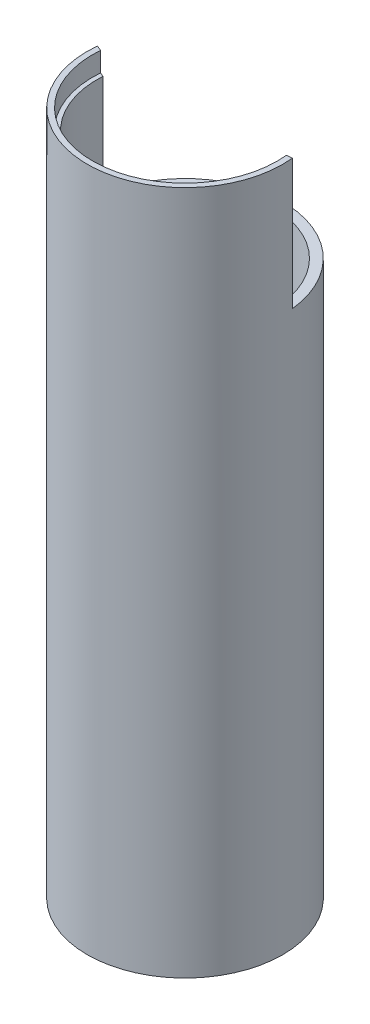
ISO-10303-21;
HEADER;
FILE_DESCRIPTION(('STEP AP214'),'2;1');
FILE_NAME('part.step','',(''),(''),'','','');
FILE_SCHEMA(('AUTOMOTIVE_DESIGN { 1 0 10303 214 1 1 1 1 }'));
ENDSEC;
DATA;
#1=APPLICATION_CONTEXT('core data for automotive mechanical design processes');
#2=APPLICATION_PROTOCOL_DEFINITION('international standard','automotive_design',2000,#1);
#3=PRODUCT_CONTEXT('',#1,'mechanical');
#4=PRODUCT('Part','Part','',(#3));
#5=PRODUCT_RELATED_PRODUCT_CATEGORY('part','',(#4));
#6=PRODUCT_DEFINITION_FORMATION('','',#4);
#7=PRODUCT_DEFINITION_CONTEXT('part definition',#1,'design');
#8=PRODUCT_DEFINITION('design','',#6,#7);
#9=PRODUCT_DEFINITION_SHAPE('','',#8);
#10=(LENGTH_UNIT() NAMED_UNIT(*) SI_UNIT(.MILLI.,.METRE.));
#11=(NAMED_UNIT(*) PLANE_ANGLE_UNIT() SI_UNIT($,.RADIAN.));
#12=(NAMED_UNIT(*) SI_UNIT($,.STERADIAN.) SOLID_ANGLE_UNIT());
#13=UNCERTAINTY_MEASURE_WITH_UNIT(LENGTH_MEASURE(1.E-05),#10,'distance_accuracy_value','');
#14=(GEOMETRIC_REPRESENTATION_CONTEXT(3) GLOBAL_UNCERTAINTY_ASSIGNED_CONTEXT((#13)) GLOBAL_UNIT_ASSIGNED_CONTEXT((#10,
#11,#12)) REPRESENTATION_CONTEXT('',''));
#15=CARTESIAN_POINT('',(0.,0.,0.));
#16=DIRECTION('',(0.,0.,1.));
#17=DIRECTION('',(1.,0.,0.));
#18=AXIS2_PLACEMENT_3D('',#15,#16,#17);
#19=CARTESIAN_POINT('',(0.,105.,0.));
#20=DIRECTION('',(0.,-1.,0.));
#21=DIRECTION('',(0.,0.,-1.));
#22=AXIS2_PLACEMENT_3D('',#19,#20,#21);
#23=CYLINDRICAL_SURFACE('',#22,13.5);
#24=DIRECTION('',(0.,1.,0.));
#25=VECTOR('',#24,1.);
#26=CARTESIAN_POINT('',(13.4267182081246,85.,-1.40471995771921));
#27=LINE('',#26,#25);
#28=CARTESIAN_POINT('',(13.4267182081246,85.,-1.40471995771921));
#29=VERTEX_POINT('',#28);
#30=CARTESIAN_POINT('',(13.4267182081246,102.,-1.40471995771921));
#31=VERTEX_POINT('',#30);
#32=EDGE_CURVE('E124',#29,#31,#27,.T.);
#33=ORIENTED_EDGE('',*,*,#32,.F.);
#34=CARTESIAN_POINT('',(0.,85.,0.));
#35=DIRECTION('',(0.,-1.,0.));
#36=DIRECTION('',(0.,0.,-1.));
#37=AXIS2_PLACEMENT_3D('',#34,#35,#36);
#38=CIRCLE('',#37,13.5);
#39=CARTESIAN_POINT('',(-13.4707558704919,85.,-0.888108257819671));
#40=VERTEX_POINT('',#39);
#41=EDGE_CURVE('E135',#40,#29,#38,.T.);
#42=ORIENTED_EDGE('',*,*,#41,.F.);
#43=DIRECTION('',(0.,1.,0.));
#44=VECTOR('',#43,1.);
#45=CARTESIAN_POINT('',(-13.4707558704919,85.,-0.888108257819671));
#46=LINE('',#45,#44);
#47=CARTESIAN_POINT('',(-13.4707558704919,102.,-0.888108257819671));
#48=VERTEX_POINT('',#47);
#49=EDGE_CURVE('E100',#40,#48,#46,.T.);
#50=ORIENTED_EDGE('',*,*,#49,.T.);
#51=CARTESIAN_POINT('',(0.,102.,0.));
#52=DIRECTION('',(0.,1.,0.));
#53=DIRECTION('',(0.,0.,1.));
#54=AXIS2_PLACEMENT_3D('',#51,#52,#53);
#55=CIRCLE('',#54,13.5);
#56=EDGE_CURVE('E143',#48,#31,#55,.T.);
#57=ORIENTED_EDGE('',*,*,#56,.T.);
#58=EDGE_LOOP('',(#33,#42,#50,#57));
#59=FACE_BOUND('',#58,.T.);
#60=CARTESIAN_POINT('',(0.,3.,0.));
#61=DIRECTION('',(0.,-1.,0.));
#62=DIRECTION('',(0.,0.,-1.));
#63=AXIS2_PLACEMENT_3D('',#60,#61,#62);
#64=CIRCLE('',#63,13.5);
#65=CARTESIAN_POINT('',(0.,3.,-13.5));
#66=VERTEX_POINT('',#65);
#67=EDGE_CURVE('E147',#66,#66,#64,.F.);
#68=ORIENTED_EDGE('',*,*,#67,.F.);
#69=EDGE_LOOP('',(#68));
#70=FACE_BOUND('',#69,.T.);
#71=ADVANCED_FACE('F43',(#59,#70),#23,.F.);
#72=CARTESIAN_POINT('',(0.,105.,0.));
#73=DIRECTION('',(0.,-1.,0.));
#74=DIRECTION('',(0.,0.,-1.));
#75=AXIS2_PLACEMENT_3D('',#72,#73,#74);
#76=CYLINDRICAL_SURFACE('',#75,15.);
#77=CARTESIAN_POINT('',(0.,85.,0.));
#78=DIRECTION('',(0.,1.,0.));
#79=DIRECTION('',(0.,0.,-1.));
#80=AXIS2_PLACEMENT_3D('',#77,#78,#79);
#81=CIRCLE('',#80,15.);
#82=CARTESIAN_POINT('',(14.9185757868051,85.,-1.56079995302135));
#83=VERTEX_POINT('',#82);
#84=CARTESIAN_POINT('',(-14.9255274093062,85.,-1.49286019239847));
#85=VERTEX_POINT('',#84);
#86=EDGE_CURVE('E105',#83,#85,#81,.T.);
#87=ORIENTED_EDGE('',*,*,#86,.F.);
#88=DIRECTION('',(0.,1.,0.));
#89=VECTOR('',#88,1.);
#90=CARTESIAN_POINT('',(14.9185757868051,85.,-1.56079995302135));
#91=LINE('',#90,#89);
#92=CARTESIAN_POINT('',(14.9185757868051,105.,-1.56079995302135));
#93=VERTEX_POINT('',#92);
#94=EDGE_CURVE('E132',#83,#93,#91,.T.);
#95=ORIENTED_EDGE('',*,*,#94,.T.);
#96=CARTESIAN_POINT('',(0.,105.,0.));
#97=DIRECTION('',(0.,1.,0.));
#98=DIRECTION('',(0.,0.,1.));
#99=AXIS2_PLACEMENT_3D('',#96,#97,#98);
#100=CIRCLE('',#99,15.);
#101=CARTESIAN_POINT('',(-14.9255274093062,105.,-1.49286019239847));
#102=VERTEX_POINT('',#101);
#103=EDGE_CURVE('E119',#102,#93,#100,.T.);
#104=ORIENTED_EDGE('',*,*,#103,.F.);
#105=DIRECTION('',(0.,1.,0.));
#106=VECTOR('',#105,1.);
#107=CARTESIAN_POINT('',(-14.9255274093062,85.,-1.49286019239847));
#108=LINE('',#107,#106);
#109=EDGE_CURVE('E97',#85,#102,#108,.T.);
#110=ORIENTED_EDGE('',*,*,#109,.F.);
#111=EDGE_LOOP('',(#87,#95,#104,#110));
#112=FACE_BOUND('',#111,.T.);
#113=CARTESIAN_POINT('',(0.,0.,0.));
#114=DIRECTION('',(0.,1.,0.));
#115=DIRECTION('',(0.,0.,1.));
#116=AXIS2_PLACEMENT_3D('',#113,#114,#115);
#117=CIRCLE('',#116,15.);
#118=CARTESIAN_POINT('',(0.,0.,15.));
#119=VERTEX_POINT('',#118);
#120=EDGE_CURVE('E156',#119,#119,#117,.T.);
#121=ORIENTED_EDGE('',*,*,#120,.T.);
#122=EDGE_LOOP('',(#121));
#123=FACE_BOUND('',#122,.T.);
#124=ADVANCED_FACE('F45',(#112,#123),#76,.T.);
#125=CARTESIAN_POINT('',(0.,105.,0.));
#126=DIRECTION('',(0.,1.,0.));
#127=DIRECTION('',(0.,0.,1.));
#128=AXIS2_PLACEMENT_3D('',#125,#126,#127);
#129=PLANE('',#128);
#130=DIRECTION('',(0.994571719120343,0.,-0.104053330201423));
#131=VECTOR('',#130,1.);
#132=CARTESIAN_POINT('',(14.9185757868051,105.,-1.56079995302135));
#133=LINE('',#132,#131);
#134=CARTESIAN_POINT('',(14.0804741107957,105.,-1.4731167133317));
#135=VERTEX_POINT('',#134);
#136=EDGE_CURVE('E114',#135,#93,#133,.T.);
#137=ORIENTED_EDGE('',*,*,#136,.F.);
#138=CARTESIAN_POINT('',(0.,105.,0.));
#139=DIRECTION('',(0.,1.,0.));
#140=DIRECTION('',(0.,0.,1.));
#141=AXIS2_PLACEMENT_3D('',#138,#139,#140);
#142=CIRCLE('',#141,14.1573240422011);
#143=CARTESIAN_POINT('',(-14.1102182734001,105.,-1.15393427581033));
#144=VERTEX_POINT('',#143);
#145=EDGE_CURVE('E138',#144,#135,#142,.T.);
#146=ORIENTED_EDGE('',*,*,#145,.F.);
#147=DIRECTION('',(0.923392747761119,0.,0.383856527080329));
#148=VECTOR('',#147,1.);
#149=CARTESIAN_POINT('',(-13.4707558704919,105.,-0.888108257819671));
#150=LINE('',#149,#148);
#151=EDGE_CURVE('E183',#102,#144,#150,.T.);
#152=ORIENTED_EDGE('',*,*,#151,.F.);
#153=ORIENTED_EDGE('',*,*,#103,.T.);
#154=EDGE_LOOP('',(#137,#146,#152,#153));
#155=FACE_BOUND('',#154,.T.);
#156=ADVANCED_FACE('F181',(#155),#129,.T.);
#157=CARTESIAN_POINT('',(0.,0.,0.));
#158=DIRECTION('',(0.,1.,0.));
#159=DIRECTION('',(0.,0.,1.));
#160=AXIS2_PLACEMENT_3D('',#157,#158,#159);
#161=PLANE('',#160);
#162=CARTESIAN_POINT('',(0.,0.,0.));
#163=DIRECTION('',(0.,-1.,0.));
#164=DIRECTION('',(0.,0.,-1.));
#165=AXIS2_PLACEMENT_3D('',#162,#163,#164);
#166=CIRCLE('',#165,14.2220153833762);
#167=CARTESIAN_POINT('',(0.,0.,-14.2220153833762));
#168=VERTEX_POINT('',#167);
#169=EDGE_CURVE('E151',#168,#168,#166,.T.);
#170=ORIENTED_EDGE('',*,*,#169,.F.);
#171=EDGE_LOOP('',(#170));
#172=FACE_BOUND('',#171,.T.);
#173=ORIENTED_EDGE('',*,*,#120,.F.);
#174=EDGE_LOOP('',(#173));
#175=FACE_BOUND('',#174,.T.);
#176=ADVANCED_FACE('F191',(#172,#175),#161,.F.);
#177=CARTESIAN_POINT('',(0.,3.,0.));
#178=DIRECTION('',(0.,-1.,0.));
#179=DIRECTION('',(0.,0.,-1.));
#180=AXIS2_PLACEMENT_3D('',#177,#178,#179);
#181=CYLINDRICAL_SURFACE('',#180,14.2220153833762);
#182=CARTESIAN_POINT('',(0.,3.,0.));
#183=DIRECTION('',(0.,-1.,0.));
#184=DIRECTION('',(0.,0.,-1.));
#185=AXIS2_PLACEMENT_3D('',#182,#183,#184);
#186=CIRCLE('',#185,14.2220153833762);
#187=CARTESIAN_POINT('',(0.,3.,-14.2220153833762));
#188=VERTEX_POINT('',#187);
#189=EDGE_CURVE('E152',#188,#188,#186,.T.);
#190=ORIENTED_EDGE('',*,*,#189,.F.);
#191=EDGE_LOOP('',(#190));
#192=FACE_BOUND('',#191,.T.);
#193=ORIENTED_EDGE('',*,*,#169,.T.);
#194=EDGE_LOOP('',(#193));
#195=FACE_BOUND('',#194,.T.);
#196=ADVANCED_FACE('F197',(#192,#195),#181,.F.);
#197=CARTESIAN_POINT('',(0.,3.,0.));
#198=DIRECTION('',(0.,-1.,0.));
#199=DIRECTION('',(0.,0.,-1.));
#200=AXIS2_PLACEMENT_3D('',#197,#198,#199);
#201=PLANE('',#200);
#202=ORIENTED_EDGE('',*,*,#67,.T.);
#203=EDGE_LOOP('',(#202));
#204=FACE_BOUND('',#203,.T.);
#205=ORIENTED_EDGE('',*,*,#189,.T.);
#206=EDGE_LOOP('',(#205));
#207=FACE_BOUND('',#206,.T.);
#208=ADVANCED_FACE('F207',(#204,#207),#201,.T.);
#209=CARTESIAN_POINT('',(0.,102.,0.));
#210=DIRECTION('',(0.,1.,0.));
#211=DIRECTION('',(0.,0.,1.));
#212=AXIS2_PLACEMENT_3D('',#209,#210,#211);
#213=CYLINDRICAL_SURFACE('',#212,14.1573240422011);
#214=ORIENTED_EDGE('',*,*,#145,.T.);
#215=DIRECTION('',(0.,1.,0.));
#216=VECTOR('',#215,1.);
#217=CARTESIAN_POINT('',(14.0804741107957,102.,-1.4731167133317));
#218=LINE('',#217,#216);
#219=CARTESIAN_POINT('',(14.0804741107957,102.,-1.4731167133317));
#220=VERTEX_POINT('',#219);
#221=EDGE_CURVE('E131',#135,#220,#218,.F.);
#222=ORIENTED_EDGE('',*,*,#221,.T.);
#223=CARTESIAN_POINT('',(0.,102.,0.));
#224=DIRECTION('',(0.,1.,0.));
#225=DIRECTION('',(0.,0.,1.));
#226=AXIS2_PLACEMENT_3D('',#223,#224,#225);
#227=CIRCLE('',#226,14.1573240422011);
#228=CARTESIAN_POINT('',(-14.1102182734001,102.,-1.15393427581033));
#229=VERTEX_POINT('',#228);
#230=EDGE_CURVE('E139',#229,#220,#227,.T.);
#231=ORIENTED_EDGE('',*,*,#230,.F.);
#232=DIRECTION('',(0.,1.,0.));
#233=VECTOR('',#232,1.);
#234=CARTESIAN_POINT('',(-14.1102182734001,102.,-1.15393427581033));
#235=LINE('',#234,#233);
#236=EDGE_CURVE('E59',#229,#144,#235,.T.);
#237=ORIENTED_EDGE('',*,*,#236,.T.);
#238=EDGE_LOOP('',(#214,#222,#231,#237));
#239=FACE_BOUND('',#238,.T.);
#240=ADVANCED_FACE('F176',(#239),#213,.F.);
#241=CARTESIAN_POINT('',(0.,102.,0.));
#242=DIRECTION('',(0.,1.,0.));
#243=DIRECTION('',(0.,0.,1.));
#244=AXIS2_PLACEMENT_3D('',#241,#242,#243);
#245=PLANE('',#244);
#246=DIRECTION('',(0.994571719120343,0.,-0.104053330201423));
#247=VECTOR('',#246,1.);
#248=CARTESIAN_POINT('',(0.,102.,0.));
#249=LINE('',#248,#247);
#250=EDGE_CURVE('E11',#31,#220,#249,.T.);
#251=ORIENTED_EDGE('',*,*,#250,.F.);
#252=ORIENTED_EDGE('',*,*,#56,.F.);
#253=DIRECTION('',(0.923392747761119,0.,0.383856527080329));
#254=VECTOR('',#253,1.);
#255=CARTESIAN_POINT('',(-1.67006948204652,102.,4.0174647014826));
#256=LINE('',#255,#254);
#257=EDGE_CURVE('E52',#229,#48,#256,.T.);
#258=ORIENTED_EDGE('',*,*,#257,.F.);
#259=ORIENTED_EDGE('',*,*,#230,.T.);
#260=EDGE_LOOP('',(#251,#252,#258,#259));
#261=FACE_BOUND('',#260,.T.);
#262=ADVANCED_FACE('F174',(#261),#245,.T.);
#263=CARTESIAN_POINT('',(14.9185757868051,85.,-1.56079995302135));
#264=DIRECTION('',(0.104053330201423,0.,0.994571719120343));
#265=DIRECTION('',(0.994571719120343,0.,-0.104053330201423));
#266=AXIS2_PLACEMENT_3D('',#263,#264,#265);
#267=PLANE('',#266);
#268=ORIENTED_EDGE('',*,*,#136,.T.);
#269=ORIENTED_EDGE('',*,*,#94,.F.);
#270=DIRECTION('',(0.994571719120343,0.,-0.104053330201423));
#271=VECTOR('',#270,1.);
#272=CARTESIAN_POINT('',(14.9185757868051,85.,-1.56079995302135));
#273=LINE('',#272,#271);
#274=EDGE_CURVE('E104',#29,#83,#273,.T.);
#275=ORIENTED_EDGE('',*,*,#274,.F.);
#276=ORIENTED_EDGE('',*,*,#32,.T.);
#277=ORIENTED_EDGE('',*,*,#250,.T.);
#278=ORIENTED_EDGE('',*,*,#221,.F.);
#279=EDGE_LOOP('',(#268,#269,#275,#276,#277,#278));
#280=FACE_BOUND('',#279,.T.);
#281=ADVANCED_FACE('F179',(#280),#267,.F.);
#282=CARTESIAN_POINT('',(-13.4707558704919,85.,-0.888108257819671));
#283=DIRECTION('',(-0.383856527080329,0.,0.923392747761119));
#284=DIRECTION('',(0.923392747761119,0.,0.383856527080329));
#285=AXIS2_PLACEMENT_3D('',#282,#283,#284);
#286=PLANE('',#285);
#287=ORIENTED_EDGE('',*,*,#257,.T.);
#288=ORIENTED_EDGE('',*,*,#49,.F.);
#289=DIRECTION('',(0.923392747761119,0.,0.383856527080329));
#290=VECTOR('',#289,1.);
#291=CARTESIAN_POINT('',(-13.4707558704919,85.,-0.888108257819671));
#292=LINE('',#291,#290);
#293=EDGE_CURVE('E93',#85,#40,#292,.T.);
#294=ORIENTED_EDGE('',*,*,#293,.F.);
#295=ORIENTED_EDGE('',*,*,#109,.T.);
#296=ORIENTED_EDGE('',*,*,#151,.T.);
#297=ORIENTED_EDGE('',*,*,#236,.F.);
#298=EDGE_LOOP('',(#287,#288,#294,#295,#296,#297));
#299=FACE_BOUND('',#298,.T.);
#300=ADVANCED_FACE('F95',(#299),#286,.F.);
#301=CARTESIAN_POINT('',(0.,85.,0.));
#302=DIRECTION('',(0.,-1.,0.));
#303=DIRECTION('',(0.,0.,-1.));
#304=AXIS2_PLACEMENT_3D('',#301,#302,#303);
#305=PLANE('',#304);
#306=ORIENTED_EDGE('',*,*,#41,.T.);
#307=ORIENTED_EDGE('',*,*,#274,.T.);
#308=ORIENTED_EDGE('',*,*,#86,.T.);
#309=ORIENTED_EDGE('',*,*,#293,.T.);
#310=EDGE_LOOP('',(#306,#307,#308,#309));
#311=FACE_BOUND('',#310,.T.);
#312=ADVANCED_FACE('F109',(#311),#305,.F.);
#313=CLOSED_SHELL('',(#71,#124,#156,#176,#196,#208,#240,#262,#281,#300,#312));
#314=MANIFOLD_SOLID_BREP('B2',#313);
#315=ADVANCED_BREP_SHAPE_REPRESENTATION('',(#18,#314),#14);
#316=SHAPE_DEFINITION_REPRESENTATION(#9,#315);
ENDSEC;
END-ISO-10303-21;
